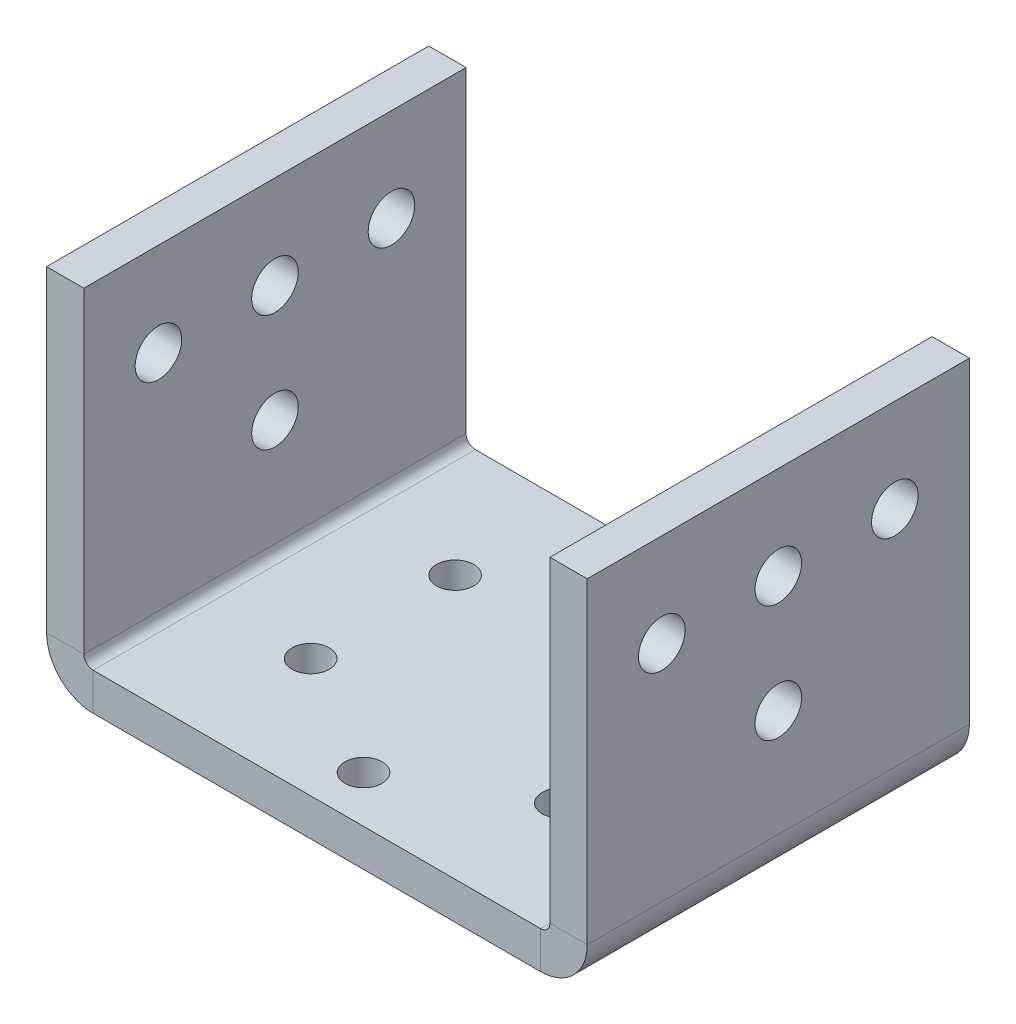
ISO-10303-21;
HEADER;
FILE_DESCRIPTION(('STEP AP214'),'2;1');
FILE_NAME('part.step','',(''),(''),'','','');
FILE_SCHEMA(('AUTOMOTIVE_DESIGN { 1 0 10303 214 1 1 1 1 }'));
ENDSEC;
DATA;
#1=APPLICATION_CONTEXT('core data for automotive mechanical design processes');
#2=APPLICATION_PROTOCOL_DEFINITION('international standard','automotive_design',2000,#1);
#3=PRODUCT_CONTEXT('',#1,'mechanical');
#4=PRODUCT('Part','Part','',(#3));
#5=PRODUCT_RELATED_PRODUCT_CATEGORY('part','',(#4));
#6=PRODUCT_DEFINITION_FORMATION('','',#4);
#7=PRODUCT_DEFINITION_CONTEXT('part definition',#1,'design');
#8=PRODUCT_DEFINITION('design','',#6,#7);
#9=PRODUCT_DEFINITION_SHAPE('','',#8);
#10=(LENGTH_UNIT() NAMED_UNIT(*) SI_UNIT(.MILLI.,.METRE.));
#11=(NAMED_UNIT(*) PLANE_ANGLE_UNIT() SI_UNIT($,.RADIAN.));
#12=(NAMED_UNIT(*) SI_UNIT($,.STERADIAN.) SOLID_ANGLE_UNIT());
#13=UNCERTAINTY_MEASURE_WITH_UNIT(LENGTH_MEASURE(1.E-05),#10,'distance_accuracy_value','');
#14=(GEOMETRIC_REPRESENTATION_CONTEXT(3) GLOBAL_UNCERTAINTY_ASSIGNED_CONTEXT((#13)) GLOBAL_UNIT_ASSIGNED_CONTEXT((#10,
#11,#12)) REPRESENTATION_CONTEXT('',''));
#15=CARTESIAN_POINT('',(0.,0.,0.));
#16=DIRECTION('',(0.,0.,1.));
#17=DIRECTION('',(1.,0.,0.));
#18=AXIS2_PLACEMENT_3D('',#15,#16,#17);
#19=CARTESIAN_POINT('',(25.,1.00000000000001,41.));
#20=DIRECTION('',(0.,0.,1.));
#21=DIRECTION('',(1.,0.,0.));
#22=AXIS2_PLACEMENT_3D('',#19,#20,#21);
#23=PLANE('',#22);
#24=DIRECTION('',(1.,0.,0.));
#25=VECTOR('',#24,1.);
#26=CARTESIAN_POINT('',(25.,1.00000000000001,41.));
#27=LINE('',#26,#25);
#28=CARTESIAN_POINT('',(25.,1.00000000000001,41.));
#29=VERTEX_POINT('',#28);
#30=CARTESIAN_POINT('',(29.,1.00000000000001,41.));
#31=VERTEX_POINT('',#30);
#32=EDGE_CURVE('E11',#29,#31,#27,.T.);
#33=ORIENTED_EDGE('',*,*,#32,.F.);
#34=CARTESIAN_POINT('',(24.,1.00000000000001,41.));
#35=DIRECTION('',(0.,0.,1.));
#36=DIRECTION('',(1.,0.,0.));
#37=AXIS2_PLACEMENT_3D('',#34,#35,#36);
#38=CIRCLE('',#37,1.);
#39=CARTESIAN_POINT('',(24.,0.,41.));
#40=VERTEX_POINT('',#39);
#41=EDGE_CURVE('E158',#29,#40,#38,.F.);
#42=ORIENTED_EDGE('',*,*,#41,.T.);
#43=DIRECTION('',(0.,1.,0.));
#44=VECTOR('',#43,1.);
#45=CARTESIAN_POINT('',(24.,-3.99999999999999,41.));
#46=LINE('',#45,#44);
#47=CARTESIAN_POINT('',(24.,-3.99999999999999,41.));
#48=VERTEX_POINT('',#47);
#49=EDGE_CURVE('E53',#48,#40,#46,.T.);
#50=ORIENTED_EDGE('',*,*,#49,.F.);
#51=CARTESIAN_POINT('',(24.,1.00000000000001,41.));
#52=DIRECTION('',(0.,0.,1.));
#53=DIRECTION('',(1.,0.,0.));
#54=AXIS2_PLACEMENT_3D('',#51,#52,#53);
#55=CIRCLE('',#54,5.);
#56=EDGE_CURVE('E386',#31,#48,#55,.F.);
#57=ORIENTED_EDGE('',*,*,#56,.F.);
#58=EDGE_LOOP('',(#33,#42,#50,#57));
#59=FACE_BOUND('',#58,.T.);
#60=ADVANCED_FACE('F43',(#59),#23,.T.);
#61=CARTESIAN_POINT('',(24.,-3.99999999999999,41.));
#62=DIRECTION('',(0.,0.,1.));
#63=DIRECTION('',(1.,0.,0.));
#64=AXIS2_PLACEMENT_3D('',#61,#62,#63);
#65=PLANE('',#64);
#66=DIRECTION('',(0.,-1.,0.));
#67=VECTOR('',#66,1.);
#68=CARTESIAN_POINT('',(25.,0.,41.));
#69=LINE('',#68,#67);
#70=CARTESIAN_POINT('',(25.,35.,41.));
#71=VERTEX_POINT('',#70);
#72=EDGE_CURVE('E164',#71,#29,#69,.T.);
#73=ORIENTED_EDGE('',*,*,#72,.T.);
#74=ORIENTED_EDGE('',*,*,#32,.T.);
#75=DIRECTION('',(0.,1.,0.));
#76=VECTOR('',#75,1.);
#77=CARTESIAN_POINT('',(29.,0.,41.));
#78=LINE('',#77,#76);
#79=CARTESIAN_POINT('',(29.,35.,41.));
#80=VERTEX_POINT('',#79);
#81=EDGE_CURVE('E389',#80,#31,#78,.F.);
#82=ORIENTED_EDGE('',*,*,#81,.F.);
#83=DIRECTION('',(1.,0.,0.));
#84=VECTOR('',#83,1.);
#85=CARTESIAN_POINT('',(25.,35.,41.));
#86=LINE('',#85,#84);
#87=EDGE_CURVE('E393',#71,#80,#86,.T.);
#88=ORIENTED_EDGE('',*,*,#87,.F.);
#89=EDGE_LOOP('',(#73,#74,#82,#88));
#90=FACE_BOUND('',#89,.T.);
#91=ADVANCED_FACE('F401',(#90),#65,.T.);
#92=CARTESIAN_POINT('',(24.,0.,0.));
#93=DIRECTION('',(0.,0.,-1.));
#94=DIRECTION('',(-1.,0.,0.));
#95=AXIS2_PLACEMENT_3D('',#92,#93,#94);
#96=PLANE('',#95);
#97=DIRECTION('',(0.,-1.,0.));
#98=VECTOR('',#97,1.);
#99=CARTESIAN_POINT('',(24.,0.,0.));
#100=LINE('',#99,#98);
#101=CARTESIAN_POINT('',(24.,0.,0.));
#102=VERTEX_POINT('',#101);
#103=CARTESIAN_POINT('',(24.,-3.99999999999999,0.));
#104=VERTEX_POINT('',#103);
#105=EDGE_CURVE('E155',#102,#104,#100,.T.);
#106=ORIENTED_EDGE('',*,*,#105,.F.);
#107=CARTESIAN_POINT('',(24.,1.00000000000001,0.));
#108=DIRECTION('',(0.,0.,1.));
#109=DIRECTION('',(1.,0.,0.));
#110=AXIS2_PLACEMENT_3D('',#107,#108,#109);
#111=CIRCLE('',#110,1.);
#112=CARTESIAN_POINT('',(25.,1.00000000000001,0.));
#113=VERTEX_POINT('',#112);
#114=EDGE_CURVE('E171',#113,#102,#111,.F.);
#115=ORIENTED_EDGE('',*,*,#114,.F.);
#116=DIRECTION('',(-1.,0.,0.));
#117=VECTOR('',#116,1.);
#118=CARTESIAN_POINT('',(29.,1.00000000000001,0.));
#119=LINE('',#118,#117);
#120=CARTESIAN_POINT('',(29.,1.00000000000001,0.));
#121=VERTEX_POINT('',#120);
#122=EDGE_CURVE('E275',#121,#113,#119,.T.);
#123=ORIENTED_EDGE('',*,*,#122,.F.);
#124=CARTESIAN_POINT('',(24.,1.00000000000001,0.));
#125=DIRECTION('',(0.,0.,1.));
#126=DIRECTION('',(1.,0.,0.));
#127=AXIS2_PLACEMENT_3D('',#124,#125,#126);
#128=CIRCLE('',#127,5.);
#129=EDGE_CURVE('E207',#121,#104,#128,.F.);
#130=ORIENTED_EDGE('',*,*,#129,.T.);
#131=EDGE_LOOP('',(#106,#115,#123,#130));
#132=FACE_BOUND('',#131,.T.);
#133=ADVANCED_FACE('F408',(#132),#96,.T.);
#134=CARTESIAN_POINT('',(29.,1.00000000000001,0.));
#135=DIRECTION('',(0.,0.,-1.));
#136=DIRECTION('',(-1.,0.,0.));
#137=AXIS2_PLACEMENT_3D('',#134,#135,#136);
#138=PLANE('',#137);
#139=DIRECTION('',(-1.,0.,0.));
#140=VECTOR('',#139,1.);
#141=CARTESIAN_POINT('',(-25.,0.,0.));
#142=LINE('',#141,#140);
#143=CARTESIAN_POINT('',(-24.,0.,0.));
#144=VERTEX_POINT('',#143);
#145=EDGE_CURVE('E225',#102,#144,#142,.T.);
#146=ORIENTED_EDGE('',*,*,#145,.F.);
#147=ORIENTED_EDGE('',*,*,#105,.T.);
#148=DIRECTION('',(-1.,0.,0.));
#149=VECTOR('',#148,1.);
#150=CARTESIAN_POINT('',(-25.,-4.,0.));
#151=LINE('',#150,#149);
#152=CARTESIAN_POINT('',(-24.,-4.,0.));
#153=VERTEX_POINT('',#152);
#154=EDGE_CURVE('E204',#104,#153,#151,.T.);
#155=ORIENTED_EDGE('',*,*,#154,.T.);
#156=DIRECTION('',(0.,1.,0.));
#157=VECTOR('',#156,1.);
#158=CARTESIAN_POINT('',(-24.,-4.,0.));
#159=LINE('',#158,#157);
#160=EDGE_CURVE('E103',#153,#144,#159,.T.);
#161=ORIENTED_EDGE('',*,*,#160,.T.);
#162=EDGE_LOOP('',(#146,#147,#155,#161));
#163=FACE_BOUND('',#162,.T.);
#164=ADVANCED_FACE('F410',(#163),#138,.T.);
#165=CARTESIAN_POINT('',(-24.,0.,41.));
#166=DIRECTION('',(0.,0.,1.));
#167=DIRECTION('',(1.,0.,0.));
#168=AXIS2_PLACEMENT_3D('',#165,#166,#167);
#169=PLANE('',#168);
#170=DIRECTION('',(0.,-1.,0.));
#171=VECTOR('',#170,1.);
#172=CARTESIAN_POINT('',(-24.,0.,41.));
#173=LINE('',#172,#171);
#174=CARTESIAN_POINT('',(-24.,0.,41.));
#175=VERTEX_POINT('',#174);
#176=CARTESIAN_POINT('',(-24.,-4.,41.));
#177=VERTEX_POINT('',#176);
#178=EDGE_CURVE('E272',#175,#177,#173,.T.);
#179=ORIENTED_EDGE('',*,*,#178,.F.);
#180=CARTESIAN_POINT('',(-24.,1.,41.));
#181=DIRECTION('',(0.,0.,1.));
#182=DIRECTION('',(1.,0.,0.));
#183=AXIS2_PLACEMENT_3D('',#180,#181,#182);
#184=CIRCLE('',#183,1.);
#185=CARTESIAN_POINT('',(-25.,1.,41.));
#186=VERTEX_POINT('',#185);
#187=EDGE_CURVE('E181',#175,#186,#184,.F.);
#188=ORIENTED_EDGE('',*,*,#187,.T.);
#189=DIRECTION('',(1.,0.,0.));
#190=VECTOR('',#189,1.);
#191=CARTESIAN_POINT('',(-29.,1.,41.));
#192=LINE('',#191,#190);
#193=CARTESIAN_POINT('',(-29.,1.,41.));
#194=VERTEX_POINT('',#193);
#195=EDGE_CURVE('E62',#194,#186,#192,.T.);
#196=ORIENTED_EDGE('',*,*,#195,.F.);
#197=CARTESIAN_POINT('',(-24.,1.,41.));
#198=DIRECTION('',(0.,0.,1.));
#199=DIRECTION('',(1.,0.,0.));
#200=AXIS2_PLACEMENT_3D('',#197,#198,#199);
#201=CIRCLE('',#200,5.);
#202=EDGE_CURVE('E380',#177,#194,#201,.F.);
#203=ORIENTED_EDGE('',*,*,#202,.F.);
#204=EDGE_LOOP('',(#179,#188,#196,#203));
#205=FACE_BOUND('',#204,.T.);
#206=ADVANCED_FACE('F460',(#205),#169,.T.);
#207=CARTESIAN_POINT('',(-29.,1.,41.));
#208=DIRECTION('',(0.,0.,1.));
#209=DIRECTION('',(1.,0.,0.));
#210=AXIS2_PLACEMENT_3D('',#207,#208,#209);
#211=PLANE('',#210);
#212=DIRECTION('',(-1.,0.,0.));
#213=VECTOR('',#212,1.);
#214=CARTESIAN_POINT('',(-25.,0.,41.));
#215=LINE('',#214,#213);
#216=EDGE_CURVE('E146',#40,#175,#215,.T.);
#217=ORIENTED_EDGE('',*,*,#216,.T.);
#218=ORIENTED_EDGE('',*,*,#178,.T.);
#219=DIRECTION('',(-1.,0.,0.));
#220=VECTOR('',#219,1.);
#221=CARTESIAN_POINT('',(-25.,-4.,41.));
#222=LINE('',#221,#220);
#223=EDGE_CURVE('E149',#48,#177,#222,.T.);
#224=ORIENTED_EDGE('',*,*,#223,.F.);
#225=ORIENTED_EDGE('',*,*,#49,.T.);
#226=EDGE_LOOP('',(#217,#218,#224,#225));
#227=FACE_BOUND('',#226,.T.);
#228=ADVANCED_FACE('F144',(#227),#211,.T.);
#229=CARTESIAN_POINT('',(-25.,1.,0.));
#230=DIRECTION('',(0.,0.,-1.));
#231=DIRECTION('',(-1.,0.,0.));
#232=AXIS2_PLACEMENT_3D('',#229,#230,#231);
#233=PLANE('',#232);
#234=DIRECTION('',(-1.,0.,0.));
#235=VECTOR('',#234,1.);
#236=CARTESIAN_POINT('',(-25.,1.,0.));
#237=LINE('',#236,#235);
#238=CARTESIAN_POINT('',(-25.,1.,0.));
#239=VERTEX_POINT('',#238);
#240=CARTESIAN_POINT('',(-29.,1.,0.));
#241=VERTEX_POINT('',#240);
#242=EDGE_CURVE('E110',#239,#241,#237,.T.);
#243=ORIENTED_EDGE('',*,*,#242,.F.);
#244=CARTESIAN_POINT('',(-24.,1.,0.));
#245=DIRECTION('',(0.,0.,1.));
#246=DIRECTION('',(1.,0.,0.));
#247=AXIS2_PLACEMENT_3D('',#244,#245,#246);
#248=CIRCLE('',#247,1.);
#249=EDGE_CURVE('E228',#144,#239,#248,.F.);
#250=ORIENTED_EDGE('',*,*,#249,.F.);
#251=ORIENTED_EDGE('',*,*,#160,.F.);
#252=CARTESIAN_POINT('',(-24.,1.,0.));
#253=DIRECTION('',(0.,0.,1.));
#254=DIRECTION('',(1.,0.,0.));
#255=AXIS2_PLACEMENT_3D('',#252,#253,#254);
#256=CIRCLE('',#255,5.);
#257=EDGE_CURVE('E201',#153,#241,#256,.F.);
#258=ORIENTED_EDGE('',*,*,#257,.T.);
#259=EDGE_LOOP('',(#243,#250,#251,#258));
#260=FACE_BOUND('',#259,.T.);
#261=ADVANCED_FACE('F423',(#260),#233,.T.);
#262=CARTESIAN_POINT('',(-24.,-4.,0.));
#263=DIRECTION('',(0.,0.,-1.));
#264=DIRECTION('',(-1.,0.,0.));
#265=AXIS2_PLACEMENT_3D('',#262,#263,#264);
#266=PLANE('',#265);
#267=DIRECTION('',(0.,1.,0.));
#268=VECTOR('',#267,1.);
#269=CARTESIAN_POINT('',(-25.,0.,0.));
#270=LINE('',#269,#268);
#271=CARTESIAN_POINT('',(-25.,35.,0.));
#272=VERTEX_POINT('',#271);
#273=EDGE_CURVE('E188',#239,#272,#270,.T.);
#274=ORIENTED_EDGE('',*,*,#273,.F.);
#275=ORIENTED_EDGE('',*,*,#242,.T.);
#276=DIRECTION('',(0.,1.,0.));
#277=VECTOR('',#276,1.);
#278=CARTESIAN_POINT('',(-29.,0.,0.));
#279=LINE('',#278,#277);
#280=CARTESIAN_POINT('',(-29.,35.,0.));
#281=VERTEX_POINT('',#280);
#282=EDGE_CURVE('E197',#241,#281,#279,.T.);
#283=ORIENTED_EDGE('',*,*,#282,.T.);
#284=DIRECTION('',(1.,0.,0.));
#285=VECTOR('',#284,1.);
#286=CARTESIAN_POINT('',(-29.,35.,0.));
#287=LINE('',#286,#285);
#288=EDGE_CURVE('E192',#281,#272,#287,.T.);
#289=ORIENTED_EDGE('',*,*,#288,.T.);
#290=EDGE_LOOP('',(#274,#275,#283,#289));
#291=FACE_BOUND('',#290,.T.);
#292=ADVANCED_FACE('F431',(#291),#266,.T.);
#293=CARTESIAN_POINT('',(-25.,0.,41.));
#294=DIRECTION('',(-1.,0.,0.));
#295=DIRECTION('',(0.,0.,1.));
#296=AXIS2_PLACEMENT_3D('',#293,#294,#295);
#297=PLANE('',#296);
#298=CARTESIAN_POINT('',(-25.,12.5,20.5));
#299=DIRECTION('',(-1.,0.,0.));
#300=DIRECTION('',(0.,0.,1.));
#301=AXIS2_PLACEMENT_3D('',#298,#299,#300);
#302=CIRCLE('',#301,2.5);
#303=CARTESIAN_POINT('',(-25.,12.5,23.));
#304=VERTEX_POINT('',#303);
#305=EDGE_CURVE('E343',#304,#304,#302,.T.);
#306=ORIENTED_EDGE('',*,*,#305,.T.);
#307=EDGE_LOOP('',(#306));
#308=FACE_BOUND('',#307,.T.);
#309=CARTESIAN_POINT('',(-25.,25.,33.));
#310=DIRECTION('',(-1.,0.,0.));
#311=DIRECTION('',(0.,0.,1.));
#312=AXIS2_PLACEMENT_3D('',#309,#310,#311);
#313=CIRCLE('',#312,2.5);
#314=CARTESIAN_POINT('',(-25.,25.,35.5));
#315=VERTEX_POINT('',#314);
#316=EDGE_CURVE('E325',#315,#315,#313,.T.);
#317=ORIENTED_EDGE('',*,*,#316,.T.);
#318=EDGE_LOOP('',(#317));
#319=FACE_BOUND('',#318,.T.);
#320=CARTESIAN_POINT('',(-25.,25.,20.5));
#321=DIRECTION('',(-1.,0.,0.));
#322=DIRECTION('',(0.,0.,1.));
#323=AXIS2_PLACEMENT_3D('',#320,#321,#322);
#324=CIRCLE('',#323,2.5);
#325=CARTESIAN_POINT('',(-25.,25.,23.));
#326=VERTEX_POINT('',#325);
#327=EDGE_CURVE('E319',#326,#326,#324,.T.);
#328=ORIENTED_EDGE('',*,*,#327,.T.);
#329=EDGE_LOOP('',(#328));
#330=FACE_BOUND('',#329,.T.);
#331=CARTESIAN_POINT('',(-25.,25.,8.));
#332=DIRECTION('',(-1.,0.,0.));
#333=DIRECTION('',(0.,0.,1.));
#334=AXIS2_PLACEMENT_3D('',#331,#332,#333);
#335=CIRCLE('',#334,2.5);
#336=CARTESIAN_POINT('',(-25.,25.,10.5));
#337=VERTEX_POINT('',#336);
#338=EDGE_CURVE('E314',#337,#337,#335,.T.);
#339=ORIENTED_EDGE('',*,*,#338,.T.);
#340=EDGE_LOOP('',(#339));
#341=FACE_BOUND('',#340,.T.);
#342=ORIENTED_EDGE('',*,*,#273,.T.);
#343=DIRECTION('',(0.,0.,-1.));
#344=VECTOR('',#343,1.);
#345=CARTESIAN_POINT('',(-25.,35.,41.));
#346=LINE('',#345,#344);
#347=CARTESIAN_POINT('',(-25.,35.,41.));
#348=VERTEX_POINT('',#347);
#349=EDGE_CURVE('E263',#348,#272,#346,.T.);
#350=ORIENTED_EDGE('',*,*,#349,.F.);
#351=DIRECTION('',(0.,1.,0.));
#352=VECTOR('',#351,1.);
#353=CARTESIAN_POINT('',(-25.,0.,41.));
#354=LINE('',#353,#352);
#355=EDGE_CURVE('E116',#186,#348,#354,.T.);
#356=ORIENTED_EDGE('',*,*,#355,.F.);
#357=DIRECTION('',(0.,0.,-1.));
#358=VECTOR('',#357,1.);
#359=CARTESIAN_POINT('',(-25.,1.,41.));
#360=LINE('',#359,#358);
#361=EDGE_CURVE('E184',#186,#239,#360,.T.);
#362=ORIENTED_EDGE('',*,*,#361,.T.);
#363=EDGE_LOOP('',(#342,#350,#356,#362));
#364=FACE_BOUND('',#363,.T.);
#365=ADVANCED_FACE('F429',(#308,#319,#330,#341,#364),#297,.F.);
#366=CARTESIAN_POINT('',(-29.,35.,41.));
#367=DIRECTION('',(0.,1.,0.));
#368=DIRECTION('',(0.,0.,1.));
#369=AXIS2_PLACEMENT_3D('',#366,#367,#368);
#370=PLANE('',#369);
#371=ORIENTED_EDGE('',*,*,#288,.F.);
#372=DIRECTION('',(0.,0.,-1.));
#373=VECTOR('',#372,1.);
#374=CARTESIAN_POINT('',(-29.,35.,41.));
#375=LINE('',#374,#373);
#376=CARTESIAN_POINT('',(-29.,35.,41.));
#377=VERTEX_POINT('',#376);
#378=EDGE_CURVE('E260',#377,#281,#375,.T.);
#379=ORIENTED_EDGE('',*,*,#378,.F.);
#380=DIRECTION('',(1.,0.,0.));
#381=VECTOR('',#380,1.);
#382=CARTESIAN_POINT('',(-29.,35.,41.));
#383=LINE('',#382,#381);
#384=EDGE_CURVE('E372',#377,#348,#383,.T.);
#385=ORIENTED_EDGE('',*,*,#384,.T.);
#386=ORIENTED_EDGE('',*,*,#349,.T.);
#387=EDGE_LOOP('',(#371,#379,#385,#386));
#388=FACE_BOUND('',#387,.T.);
#389=ADVANCED_FACE('F434',(#388),#370,.T.);
#390=CARTESIAN_POINT('',(-29.,0.,41.));
#391=DIRECTION('',(-1.,0.,0.));
#392=DIRECTION('',(0.,0.,1.));
#393=AXIS2_PLACEMENT_3D('',#390,#391,#392);
#394=PLANE('',#393);
#395=CARTESIAN_POINT('',(-29.,12.5,20.5));
#396=DIRECTION('',(1.,0.,0.));
#397=DIRECTION('',(0.,0.,-1.));
#398=AXIS2_PLACEMENT_3D('',#395,#396,#397);
#399=CIRCLE('',#398,2.5);
#400=CARTESIAN_POINT('',(-29.,12.5,18.));
#401=VERTEX_POINT('',#400);
#402=EDGE_CURVE('E309',#401,#401,#399,.T.);
#403=ORIENTED_EDGE('',*,*,#402,.T.);
#404=EDGE_LOOP('',(#403));
#405=FACE_BOUND('',#404,.T.);
#406=CARTESIAN_POINT('',(-29.,25.,33.));
#407=DIRECTION('',(1.,0.,0.));
#408=DIRECTION('',(0.,0.,-1.));
#409=AXIS2_PLACEMENT_3D('',#406,#407,#408);
#410=CIRCLE('',#409,2.5);
#411=CARTESIAN_POINT('',(-29.,25.,30.5));
#412=VERTEX_POINT('',#411);
#413=EDGE_CURVE('E494',#412,#412,#410,.T.);
#414=ORIENTED_EDGE('',*,*,#413,.T.);
#415=EDGE_LOOP('',(#414));
#416=FACE_BOUND('',#415,.T.);
#417=CARTESIAN_POINT('',(-29.,25.,20.5));
#418=DIRECTION('',(1.,0.,0.));
#419=DIRECTION('',(0.,0.,-1.));
#420=AXIS2_PLACEMENT_3D('',#417,#418,#419);
#421=CIRCLE('',#420,2.5);
#422=CARTESIAN_POINT('',(-29.,25.,18.));
#423=VERTEX_POINT('',#422);
#424=EDGE_CURVE('E490',#423,#423,#421,.T.);
#425=ORIENTED_EDGE('',*,*,#424,.T.);
#426=EDGE_LOOP('',(#425));
#427=FACE_BOUND('',#426,.T.);
#428=CARTESIAN_POINT('',(-29.,25.,8.));
#429=DIRECTION('',(1.,0.,0.));
#430=DIRECTION('',(0.,0.,-1.));
#431=AXIS2_PLACEMENT_3D('',#428,#429,#430);
#432=CIRCLE('',#431,2.5);
#433=CARTESIAN_POINT('',(-29.,25.,5.5));
#434=VERTEX_POINT('',#433);
#435=EDGE_CURVE('E486',#434,#434,#432,.T.);
#436=ORIENTED_EDGE('',*,*,#435,.T.);
#437=EDGE_LOOP('',(#436));
#438=FACE_BOUND('',#437,.T.);
#439=ORIENTED_EDGE('',*,*,#282,.F.);
#440=DIRECTION('',(0.,0.,-1.));
#441=VECTOR('',#440,1.);
#442=CARTESIAN_POINT('',(-29.,1.,41.));
#443=LINE('',#442,#441);
#444=EDGE_CURVE('E256',#194,#241,#443,.T.);
#445=ORIENTED_EDGE('',*,*,#444,.F.);
#446=DIRECTION('',(0.,1.,0.));
#447=VECTOR('',#446,1.);
#448=CARTESIAN_POINT('',(-29.,0.,41.));
#449=LINE('',#448,#447);
#450=EDGE_CURVE('E376',#194,#377,#449,.T.);
#451=ORIENTED_EDGE('',*,*,#450,.T.);
#452=ORIENTED_EDGE('',*,*,#378,.T.);
#453=EDGE_LOOP('',(#439,#445,#451,#452));
#454=FACE_BOUND('',#453,.T.);
#455=ADVANCED_FACE('F437',(#405,#416,#427,#438,#454),#394,.T.);
#456=CARTESIAN_POINT('',(-24.,1.,41.));
#457=DIRECTION('',(0.,0.,-1.));
#458=DIRECTION('',(-1.,0.,0.));
#459=AXIS2_PLACEMENT_3D('',#456,#457,#458);
#460=CYLINDRICAL_SURFACE('',#459,5.);
#461=ORIENTED_EDGE('',*,*,#257,.F.);
#462=DIRECTION('',(0.,0.,-1.));
#463=VECTOR('',#462,1.);
#464=CARTESIAN_POINT('',(-24.,-4.,41.));
#465=LINE('',#464,#463);
#466=EDGE_CURVE('E252',#177,#153,#465,.T.);
#467=ORIENTED_EDGE('',*,*,#466,.F.);
#468=ORIENTED_EDGE('',*,*,#202,.T.);
#469=ORIENTED_EDGE('',*,*,#444,.T.);
#470=EDGE_LOOP('',(#461,#467,#468,#469));
#471=FACE_BOUND('',#470,.T.);
#472=ADVANCED_FACE('F420',(#471),#460,.T.);
#473=CARTESIAN_POINT('',(-25.,-4.,41.));
#474=DIRECTION('',(0.,-1.,0.));
#475=DIRECTION('',(1.,0.,0.));
#476=AXIS2_PLACEMENT_3D('',#473,#474,#475);
#477=PLANE('',#476);
#478=CARTESIAN_POINT('',(-13.4233937586588,-4.,12.75));
#479=DIRECTION('',(0.,-1.,0.));
#480=DIRECTION('',(1.,0.,0.));
#481=AXIS2_PLACEMENT_3D('',#478,#479,#480);
#482=CIRCLE('',#481,1.99999999999997);
#483=CARTESIAN_POINT('',(-11.4233937586588,-4.,12.75));
#484=VERTEX_POINT('',#483);
#485=EDGE_CURVE('E347',#484,#484,#482,.T.);
#486=ORIENTED_EDGE('',*,*,#485,.F.);
#487=EDGE_LOOP('',(#486));
#488=FACE_BOUND('',#487,.T.);
#489=CARTESIAN_POINT('',(0.,-4.,5.));
#490=DIRECTION('',(0.,-1.,0.));
#491=DIRECTION('',(1.,0.,0.));
#492=AXIS2_PLACEMENT_3D('',#489,#490,#491);
#493=CIRCLE('',#492,2.00000000000001);
#494=CARTESIAN_POINT('',(2.00000000000001,-4.,5.));
#495=VERTEX_POINT('',#494);
#496=EDGE_CURVE('E360',#495,#495,#493,.T.);
#497=ORIENTED_EDGE('',*,*,#496,.F.);
#498=EDGE_LOOP('',(#497));
#499=FACE_BOUND('',#498,.T.);
#500=CARTESIAN_POINT('',(13.4233937586588,-3.99999999999999,12.75));
#501=DIRECTION('',(0.,-1.,0.));
#502=DIRECTION('',(1.,0.,0.));
#503=AXIS2_PLACEMENT_3D('',#500,#501,#502);
#504=CIRCLE('',#503,2.);
#505=CARTESIAN_POINT('',(15.4233937586588,-3.99999999999999,12.75));
#506=VERTEX_POINT('',#505);
#507=EDGE_CURVE('E356',#506,#506,#504,.T.);
#508=ORIENTED_EDGE('',*,*,#507,.F.);
#509=EDGE_LOOP('',(#508));
#510=FACE_BOUND('',#509,.T.);
#511=CARTESIAN_POINT('',(13.4233937586588,-3.99999999999999,28.25));
#512=DIRECTION('',(0.,-1.,0.));
#513=DIRECTION('',(1.,0.,0.));
#514=AXIS2_PLACEMENT_3D('',#511,#512,#513);
#515=CIRCLE('',#514,2.);
#516=CARTESIAN_POINT('',(15.4233937586588,-3.99999999999999,28.25));
#517=VERTEX_POINT('',#516);
#518=EDGE_CURVE('E352',#517,#517,#515,.T.);
#519=ORIENTED_EDGE('',*,*,#518,.F.);
#520=EDGE_LOOP('',(#519));
#521=FACE_BOUND('',#520,.T.);
#522=CARTESIAN_POINT('',(0.,-4.,36.));
#523=DIRECTION('',(0.,-1.,0.));
#524=DIRECTION('',(1.,0.,0.));
#525=AXIS2_PLACEMENT_3D('',#522,#523,#524);
#526=CIRCLE('',#525,2.);
#527=CARTESIAN_POINT('',(2.,-4.,36.));
#528=VERTEX_POINT('',#527);
#529=EDGE_CURVE('E348',#528,#528,#526,.T.);
#530=ORIENTED_EDGE('',*,*,#529,.F.);
#531=EDGE_LOOP('',(#530));
#532=FACE_BOUND('',#531,.T.);
#533=CARTESIAN_POINT('',(-13.4233937586588,-4.,28.25));
#534=DIRECTION('',(0.,-1.,0.));
#535=DIRECTION('',(1.,0.,0.));
#536=AXIS2_PLACEMENT_3D('',#533,#534,#535);
#537=CIRCLE('',#536,2.);
#538=CARTESIAN_POINT('',(-11.4233937586588,-4.,28.25));
#539=VERTEX_POINT('',#538);
#540=EDGE_CURVE('E285',#539,#539,#537,.T.);
#541=ORIENTED_EDGE('',*,*,#540,.F.);
#542=EDGE_LOOP('',(#541));
#543=FACE_BOUND('',#542,.T.);
#544=ORIENTED_EDGE('',*,*,#154,.F.);
#545=DIRECTION('',(0.,0.,-1.));
#546=VECTOR('',#545,1.);
#547=CARTESIAN_POINT('',(24.,-3.99999999999999,41.));
#548=LINE('',#547,#546);
#549=EDGE_CURVE('E248',#48,#104,#548,.T.);
#550=ORIENTED_EDGE('',*,*,#549,.F.);
#551=ORIENTED_EDGE('',*,*,#223,.T.);
#552=ORIENTED_EDGE('',*,*,#466,.T.);
#553=EDGE_LOOP('',(#544,#550,#551,#552));
#554=FACE_BOUND('',#553,.T.);
#555=ADVANCED_FACE('F415',(#488,#499,#510,#521,#532,#543,#554),#477,.T.);
#556=CARTESIAN_POINT('',(24.,1.00000000000001,41.));
#557=DIRECTION('',(0.,0.,-1.));
#558=DIRECTION('',(-1.,0.,0.));
#559=AXIS2_PLACEMENT_3D('',#556,#557,#558);
#560=CYLINDRICAL_SURFACE('',#559,5.);
#561=ORIENTED_EDGE('',*,*,#129,.F.);
#562=DIRECTION('',(0.,0.,-1.));
#563=VECTOR('',#562,1.);
#564=CARTESIAN_POINT('',(29.,1.00000000000001,41.));
#565=LINE('',#564,#563);
#566=EDGE_CURVE('E244',#31,#121,#565,.T.);
#567=ORIENTED_EDGE('',*,*,#566,.F.);
#568=ORIENTED_EDGE('',*,*,#56,.T.);
#569=ORIENTED_EDGE('',*,*,#549,.T.);
#570=EDGE_LOOP('',(#561,#567,#568,#569));
#571=FACE_BOUND('',#570,.T.);
#572=ADVANCED_FACE('F413',(#571),#560,.T.);
#573=CARTESIAN_POINT('',(29.,0.,41.));
#574=DIRECTION('',(1.,0.,0.));
#575=DIRECTION('',(0.,0.,-1.));
#576=AXIS2_PLACEMENT_3D('',#573,#574,#575);
#577=PLANE('',#576);
#578=CARTESIAN_POINT('',(29.,12.5,20.5));
#579=DIRECTION('',(1.,0.,0.));
#580=DIRECTION('',(0.,0.,-1.));
#581=AXIS2_PLACEMENT_3D('',#578,#579,#580);
#582=CIRCLE('',#581,2.5);
#583=CARTESIAN_POINT('',(29.,12.5,18.));
#584=VERTEX_POINT('',#583);
#585=EDGE_CURVE('E339',#584,#584,#582,.T.);
#586=ORIENTED_EDGE('',*,*,#585,.F.);
#587=EDGE_LOOP('',(#586));
#588=FACE_BOUND('',#587,.T.);
#589=CARTESIAN_POINT('',(29.,25.,33.));
#590=DIRECTION('',(1.,0.,0.));
#591=DIRECTION('',(0.,0.,-1.));
#592=AXIS2_PLACEMENT_3D('',#589,#590,#591);
#593=CIRCLE('',#592,2.5);
#594=CARTESIAN_POINT('',(29.,25.,30.5));
#595=VERTEX_POINT('',#594);
#596=EDGE_CURVE('E318',#595,#595,#593,.T.);
#597=ORIENTED_EDGE('',*,*,#596,.F.);
#598=EDGE_LOOP('',(#597));
#599=FACE_BOUND('',#598,.T.);
#600=CARTESIAN_POINT('',(29.,25.,20.5));
#601=DIRECTION('',(1.,0.,0.));
#602=DIRECTION('',(0.,0.,-1.));
#603=AXIS2_PLACEMENT_3D('',#600,#601,#602);
#604=CIRCLE('',#603,2.5);
#605=CARTESIAN_POINT('',(29.,25.,18.));
#606=VERTEX_POINT('',#605);
#607=EDGE_CURVE('E313',#606,#606,#604,.T.);
#608=ORIENTED_EDGE('',*,*,#607,.F.);
#609=EDGE_LOOP('',(#608));
#610=FACE_BOUND('',#609,.T.);
#611=CARTESIAN_POINT('',(29.,25.,8.));
#612=DIRECTION('',(1.,0.,0.));
#613=DIRECTION('',(0.,0.,-1.));
#614=AXIS2_PLACEMENT_3D('',#611,#612,#613);
#615=CIRCLE('',#614,2.5);
#616=CARTESIAN_POINT('',(29.,25.,5.5));
#617=VERTEX_POINT('',#616);
#618=EDGE_CURVE('E308',#617,#617,#615,.T.);
#619=ORIENTED_EDGE('',*,*,#618,.F.);
#620=EDGE_LOOP('',(#619));
#621=FACE_BOUND('',#620,.T.);
#622=DIRECTION('',(0.,1.,0.));
#623=VECTOR('',#622,1.);
#624=CARTESIAN_POINT('',(29.,0.,0.));
#625=LINE('',#624,#623);
#626=CARTESIAN_POINT('',(29.,35.,0.));
#627=VERTEX_POINT('',#626);
#628=EDGE_CURVE('E211',#627,#121,#625,.F.);
#629=ORIENTED_EDGE('',*,*,#628,.F.);
#630=DIRECTION('',(0.,0.,-1.));
#631=VECTOR('',#630,1.);
#632=CARTESIAN_POINT('',(29.,35.,41.));
#633=LINE('',#632,#631);
#634=EDGE_CURVE('E241',#80,#627,#633,.T.);
#635=ORIENTED_EDGE('',*,*,#634,.F.);
#636=ORIENTED_EDGE('',*,*,#81,.T.);
#637=ORIENTED_EDGE('',*,*,#566,.T.);
#638=EDGE_LOOP('',(#629,#635,#636,#637));
#639=FACE_BOUND('',#638,.T.);
#640=ADVANCED_FACE('F587',(#588,#599,#610,#621,#639),#577,.T.);
#641=CARTESIAN_POINT('',(25.,35.,41.));
#642=DIRECTION('',(0.,1.,0.));
#643=DIRECTION('',(0.,0.,1.));
#644=AXIS2_PLACEMENT_3D('',#641,#642,#643);
#645=PLANE('',#644);
#646=DIRECTION('',(1.,0.,0.));
#647=VECTOR('',#646,1.);
#648=CARTESIAN_POINT('',(25.,35.,0.));
#649=LINE('',#648,#647);
#650=CARTESIAN_POINT('',(25.,35.,0.));
#651=VERTEX_POINT('',#650);
#652=EDGE_CURVE('E215',#651,#627,#649,.T.);
#653=ORIENTED_EDGE('',*,*,#652,.F.);
#654=DIRECTION('',(0.,0.,-1.));
#655=VECTOR('',#654,1.);
#656=CARTESIAN_POINT('',(25.,35.,41.));
#657=LINE('',#656,#655);
#658=EDGE_CURVE('E238',#71,#651,#657,.T.);
#659=ORIENTED_EDGE('',*,*,#658,.F.);
#660=ORIENTED_EDGE('',*,*,#87,.T.);
#661=ORIENTED_EDGE('',*,*,#634,.T.);
#662=EDGE_LOOP('',(#653,#659,#660,#661));
#663=FACE_BOUND('',#662,.T.);
#664=ADVANCED_FACE('F533',(#663),#645,.T.);
#665=CARTESIAN_POINT('',(25.,0.,41.));
#666=DIRECTION('',(1.,0.,0.));
#667=DIRECTION('',(0.,0.,-1.));
#668=AXIS2_PLACEMENT_3D('',#665,#666,#667);
#669=PLANE('',#668);
#670=CARTESIAN_POINT('',(25.,12.5,20.5));
#671=DIRECTION('',(1.,0.,0.));
#672=DIRECTION('',(0.,0.,-1.));
#673=AXIS2_PLACEMENT_3D('',#670,#671,#672);
#674=CIRCLE('',#673,2.5);
#675=CARTESIAN_POINT('',(25.,12.5,18.));
#676=VERTEX_POINT('',#675);
#677=EDGE_CURVE('E46',#676,#676,#674,.T.);
#678=ORIENTED_EDGE('',*,*,#677,.T.);
#679=EDGE_LOOP('',(#678));
#680=FACE_BOUND('',#679,.T.);
#681=CARTESIAN_POINT('',(25.,25.,33.));
#682=DIRECTION('',(1.,0.,0.));
#683=DIRECTION('',(0.,0.,-1.));
#684=AXIS2_PLACEMENT_3D('',#681,#682,#683);
#685=CIRCLE('',#684,2.5);
#686=CARTESIAN_POINT('',(25.,25.,30.5));
#687=VERTEX_POINT('',#686);
#688=EDGE_CURVE('E315',#687,#687,#685,.T.);
#689=ORIENTED_EDGE('',*,*,#688,.T.);
#690=EDGE_LOOP('',(#689));
#691=FACE_BOUND('',#690,.T.);
#692=CARTESIAN_POINT('',(25.,25.,20.5));
#693=DIRECTION('',(1.,0.,0.));
#694=DIRECTION('',(0.,0.,-1.));
#695=AXIS2_PLACEMENT_3D('',#692,#693,#694);
#696=CIRCLE('',#695,2.5);
#697=CARTESIAN_POINT('',(25.,25.,18.));
#698=VERTEX_POINT('',#697);
#699=EDGE_CURVE('E310',#698,#698,#696,.T.);
#700=ORIENTED_EDGE('',*,*,#699,.T.);
#701=EDGE_LOOP('',(#700));
#702=FACE_BOUND('',#701,.T.);
#703=CARTESIAN_POINT('',(25.,25.,8.));
#704=DIRECTION('',(1.,0.,0.));
#705=DIRECTION('',(0.,0.,-1.));
#706=AXIS2_PLACEMENT_3D('',#703,#704,#705);
#707=CIRCLE('',#706,2.5);
#708=CARTESIAN_POINT('',(25.,25.,5.5));
#709=VERTEX_POINT('',#708);
#710=EDGE_CURVE('E304',#709,#709,#707,.T.);
#711=ORIENTED_EDGE('',*,*,#710,.T.);
#712=EDGE_LOOP('',(#711));
#713=FACE_BOUND('',#712,.T.);
#714=DIRECTION('',(0.,-1.,0.));
#715=VECTOR('',#714,1.);
#716=CARTESIAN_POINT('',(25.,0.,0.));
#717=LINE('',#716,#715);
#718=EDGE_CURVE('E219',#651,#113,#717,.T.);
#719=ORIENTED_EDGE('',*,*,#718,.T.);
#720=DIRECTION('',(0.,0.,-1.));
#721=VECTOR('',#720,1.);
#722=CARTESIAN_POINT('',(25.,1.00000000000001,41.));
#723=LINE('',#722,#721);
#724=EDGE_CURVE('E174',#29,#113,#723,.T.);
#725=ORIENTED_EDGE('',*,*,#724,.F.);
#726=ORIENTED_EDGE('',*,*,#72,.F.);
#727=ORIENTED_EDGE('',*,*,#658,.T.);
#728=EDGE_LOOP('',(#719,#725,#726,#727));
#729=FACE_BOUND('',#728,.T.);
#730=ADVANCED_FACE('F405',(#680,#691,#702,#713,#729),#669,.F.);
#731=CARTESIAN_POINT('',(24.,1.00000000000001,41.));
#732=DIRECTION('',(0.,0.,-1.));
#733=DIRECTION('',(-1.,0.,0.));
#734=AXIS2_PLACEMENT_3D('',#731,#732,#733);
#735=CYLINDRICAL_SURFACE('',#734,1.);
#736=ORIENTED_EDGE('',*,*,#114,.T.);
#737=DIRECTION('',(0.,0.,-1.));
#738=VECTOR('',#737,1.);
#739=CARTESIAN_POINT('',(24.,0.,41.));
#740=LINE('',#739,#738);
#741=EDGE_CURVE('E168',#40,#102,#740,.T.);
#742=ORIENTED_EDGE('',*,*,#741,.F.);
#743=ORIENTED_EDGE('',*,*,#41,.F.);
#744=ORIENTED_EDGE('',*,*,#724,.T.);
#745=EDGE_LOOP('',(#736,#742,#743,#744));
#746=FACE_BOUND('',#745,.T.);
#747=ADVANCED_FACE('F169',(#746),#735,.F.);
#748=CARTESIAN_POINT('',(-25.,0.,41.));
#749=DIRECTION('',(0.,-1.,0.));
#750=DIRECTION('',(1.,0.,0.));
#751=AXIS2_PLACEMENT_3D('',#748,#749,#750);
#752=PLANE('',#751);
#753=CARTESIAN_POINT('',(-13.4233937586588,0.,12.75));
#754=DIRECTION('',(0.,-1.,0.));
#755=DIRECTION('',(1.,0.,0.));
#756=AXIS2_PLACEMENT_3D('',#753,#754,#755);
#757=CIRCLE('',#756,1.99999999999997);
#758=CARTESIAN_POINT('',(-11.4233937586588,0.,12.75));
#759=VERTEX_POINT('',#758);
#760=EDGE_CURVE('E193',#759,#759,#757,.T.);
#761=ORIENTED_EDGE('',*,*,#760,.T.);
#762=EDGE_LOOP('',(#761));
#763=FACE_BOUND('',#762,.T.);
#764=CARTESIAN_POINT('',(0.,0.,5.));
#765=DIRECTION('',(0.,-1.,0.));
#766=DIRECTION('',(1.,0.,0.));
#767=AXIS2_PLACEMENT_3D('',#764,#765,#766);
#768=CIRCLE('',#767,2.00000000000001);
#769=CARTESIAN_POINT('',(2.00000000000001,0.,5.));
#770=VERTEX_POINT('',#769);
#771=EDGE_CURVE('E297',#770,#770,#768,.T.);
#772=ORIENTED_EDGE('',*,*,#771,.T.);
#773=EDGE_LOOP('',(#772));
#774=FACE_BOUND('',#773,.T.);
#775=CARTESIAN_POINT('',(13.4233937586588,0.,12.75));
#776=DIRECTION('',(0.,-1.,0.));
#777=DIRECTION('',(1.,0.,0.));
#778=AXIS2_PLACEMENT_3D('',#775,#776,#777);
#779=CIRCLE('',#778,2.);
#780=CARTESIAN_POINT('',(15.4233937586588,0.,12.75));
#781=VERTEX_POINT('',#780);
#782=EDGE_CURVE('E293',#781,#781,#779,.T.);
#783=ORIENTED_EDGE('',*,*,#782,.T.);
#784=EDGE_LOOP('',(#783));
#785=FACE_BOUND('',#784,.T.);
#786=CARTESIAN_POINT('',(13.4233937586588,0.,28.25));
#787=DIRECTION('',(0.,-1.,0.));
#788=DIRECTION('',(1.,0.,0.));
#789=AXIS2_PLACEMENT_3D('',#786,#787,#788);
#790=CIRCLE('',#789,2.);
#791=CARTESIAN_POINT('',(15.4233937586588,0.,28.25));
#792=VERTEX_POINT('',#791);
#793=EDGE_CURVE('E289',#792,#792,#790,.T.);
#794=ORIENTED_EDGE('',*,*,#793,.T.);
#795=EDGE_LOOP('',(#794));
#796=FACE_BOUND('',#795,.T.);
#797=CARTESIAN_POINT('',(0.,0.,36.));
#798=DIRECTION('',(0.,-1.,0.));
#799=DIRECTION('',(1.,0.,0.));
#800=AXIS2_PLACEMENT_3D('',#797,#798,#799);
#801=CIRCLE('',#800,2.);
#802=CARTESIAN_POINT('',(2.,0.,36.));
#803=VERTEX_POINT('',#802);
#804=EDGE_CURVE('E284',#803,#803,#801,.T.);
#805=ORIENTED_EDGE('',*,*,#804,.T.);
#806=EDGE_LOOP('',(#805));
#807=FACE_BOUND('',#806,.T.);
#808=CARTESIAN_POINT('',(-13.4233937586588,0.,28.25));
#809=DIRECTION('',(0.,-1.,0.));
#810=DIRECTION('',(1.,0.,0.));
#811=AXIS2_PLACEMENT_3D('',#808,#809,#810);
#812=CIRCLE('',#811,2.);
#813=CARTESIAN_POINT('',(-11.4233937586588,0.,28.25));
#814=VERTEX_POINT('',#813);
#815=EDGE_CURVE('E280',#814,#814,#812,.T.);
#816=ORIENTED_EDGE('',*,*,#815,.T.);
#817=EDGE_LOOP('',(#816));
#818=FACE_BOUND('',#817,.T.);
#819=ORIENTED_EDGE('',*,*,#145,.T.);
#820=DIRECTION('',(0.,0.,-1.));
#821=VECTOR('',#820,1.);
#822=CARTESIAN_POINT('',(-24.,0.,41.));
#823=LINE('',#822,#821);
#824=EDGE_CURVE('E175',#175,#144,#823,.T.);
#825=ORIENTED_EDGE('',*,*,#824,.F.);
#826=ORIENTED_EDGE('',*,*,#216,.F.);
#827=ORIENTED_EDGE('',*,*,#741,.T.);
#828=EDGE_LOOP('',(#819,#825,#826,#827));
#829=FACE_BOUND('',#828,.T.);
#830=ADVANCED_FACE('F177',(#763,#774,#785,#796,#807,#818,#829),#752,.F.);
#831=CARTESIAN_POINT('',(-24.,1.,41.));
#832=DIRECTION('',(0.,0.,-1.));
#833=DIRECTION('',(-1.,0.,0.));
#834=AXIS2_PLACEMENT_3D('',#831,#832,#833);
#835=CYLINDRICAL_SURFACE('',#834,1.);
#836=ORIENTED_EDGE('',*,*,#249,.T.);
#837=ORIENTED_EDGE('',*,*,#361,.F.);
#838=ORIENTED_EDGE('',*,*,#187,.F.);
#839=ORIENTED_EDGE('',*,*,#824,.T.);
#840=EDGE_LOOP('',(#836,#837,#838,#839));
#841=FACE_BOUND('',#840,.T.);
#842=ADVANCED_FACE('F426',(#841),#835,.F.);
#843=CARTESIAN_POINT('',(-24.,1.,41.));
#844=DIRECTION('',(0.,0.,1.));
#845=DIRECTION('',(1.,0.,0.));
#846=AXIS2_PLACEMENT_3D('',#843,#844,#845);
#847=PLANE('',#846);
#848=ORIENTED_EDGE('',*,*,#355,.T.);
#849=ORIENTED_EDGE('',*,*,#384,.F.);
#850=ORIENTED_EDGE('',*,*,#450,.F.);
#851=ORIENTED_EDGE('',*,*,#195,.T.);
#852=EDGE_LOOP('',(#848,#849,#850,#851));
#853=FACE_BOUND('',#852,.T.);
#854=ADVANCED_FACE('F435',(#853),#847,.T.);
#855=CARTESIAN_POINT('',(-24.,1.,0.));
#856=DIRECTION('',(0.,0.,1.));
#857=DIRECTION('',(1.,0.,0.));
#858=AXIS2_PLACEMENT_3D('',#855,#856,#857);
#859=PLANE('',#858);
#860=ORIENTED_EDGE('',*,*,#628,.T.);
#861=ORIENTED_EDGE('',*,*,#122,.T.);
#862=ORIENTED_EDGE('',*,*,#718,.F.);
#863=ORIENTED_EDGE('',*,*,#652,.T.);
#864=EDGE_LOOP('',(#860,#861,#862,#863));
#865=FACE_BOUND('',#864,.T.);
#866=ADVANCED_FACE('F571',(#865),#859,.F.);
#867=CARTESIAN_POINT('',(-13.4233937586588,35.,28.25));
#868=DIRECTION('',(0.,-1.,0.));
#869=DIRECTION('',(1.,0.,0.));
#870=AXIS2_PLACEMENT_3D('',#867,#868,#869);
#871=CYLINDRICAL_SURFACE('',#870,2.);
#872=ORIENTED_EDGE('',*,*,#540,.T.);
#873=EDGE_LOOP('',(#872));
#874=FACE_BOUND('',#873,.T.);
#875=ORIENTED_EDGE('',*,*,#815,.F.);
#876=EDGE_LOOP('',(#875));
#877=FACE_BOUND('',#876,.T.);
#878=ADVANCED_FACE('F557',(#874,#877),#871,.F.);
#879=CARTESIAN_POINT('',(0.,35.,36.));
#880=DIRECTION('',(0.,-1.,0.));
#881=DIRECTION('',(1.,0.,0.));
#882=AXIS2_PLACEMENT_3D('',#879,#880,#881);
#883=CYLINDRICAL_SURFACE('',#882,2.);
#884=ORIENTED_EDGE('',*,*,#529,.T.);
#885=EDGE_LOOP('',(#884));
#886=FACE_BOUND('',#885,.T.);
#887=ORIENTED_EDGE('',*,*,#804,.F.);
#888=EDGE_LOOP('',(#887));
#889=FACE_BOUND('',#888,.T.);
#890=ADVANCED_FACE('F553',(#886,#889),#883,.F.);
#891=CARTESIAN_POINT('',(13.4233937586588,35.,28.25));
#892=DIRECTION('',(0.,-1.,0.));
#893=DIRECTION('',(1.,0.,0.));
#894=AXIS2_PLACEMENT_3D('',#891,#892,#893);
#895=CYLINDRICAL_SURFACE('',#894,2.);
#896=ORIENTED_EDGE('',*,*,#518,.T.);
#897=EDGE_LOOP('',(#896));
#898=FACE_BOUND('',#897,.T.);
#899=ORIENTED_EDGE('',*,*,#793,.F.);
#900=EDGE_LOOP('',(#899));
#901=FACE_BOUND('',#900,.T.);
#902=ADVANCED_FACE('F556',(#898,#901),#895,.F.);
#903=CARTESIAN_POINT('',(13.4233937586588,35.,12.75));
#904=DIRECTION('',(0.,-1.,0.));
#905=DIRECTION('',(1.,0.,0.));
#906=AXIS2_PLACEMENT_3D('',#903,#904,#905);
#907=CYLINDRICAL_SURFACE('',#906,2.);
#908=ORIENTED_EDGE('',*,*,#507,.T.);
#909=EDGE_LOOP('',(#908));
#910=FACE_BOUND('',#909,.T.);
#911=ORIENTED_EDGE('',*,*,#782,.F.);
#912=EDGE_LOOP('',(#911));
#913=FACE_BOUND('',#912,.T.);
#914=ADVANCED_FACE('F561',(#910,#913),#907,.F.);
#915=CARTESIAN_POINT('',(0.,35.,5.));
#916=DIRECTION('',(0.,-1.,0.));
#917=DIRECTION('',(1.,0.,0.));
#918=AXIS2_PLACEMENT_3D('',#915,#916,#917);
#919=CYLINDRICAL_SURFACE('',#918,2.00000000000001);
#920=ORIENTED_EDGE('',*,*,#496,.T.);
#921=EDGE_LOOP('',(#920));
#922=FACE_BOUND('',#921,.T.);
#923=ORIENTED_EDGE('',*,*,#771,.F.);
#924=EDGE_LOOP('',(#923));
#925=FACE_BOUND('',#924,.T.);
#926=ADVANCED_FACE('F549',(#922,#925),#919,.F.);
#927=CARTESIAN_POINT('',(-13.4233937586588,35.,12.75));
#928=DIRECTION('',(0.,-1.,0.));
#929=DIRECTION('',(1.,0.,0.));
#930=AXIS2_PLACEMENT_3D('',#927,#928,#929);
#931=CYLINDRICAL_SURFACE('',#930,1.99999999999997);
#932=ORIENTED_EDGE('',*,*,#485,.T.);
#933=EDGE_LOOP('',(#932));
#934=FACE_BOUND('',#933,.T.);
#935=ORIENTED_EDGE('',*,*,#760,.F.);
#936=EDGE_LOOP('',(#935));
#937=FACE_BOUND('',#936,.T.);
#938=ADVANCED_FACE('F541',(#934,#937),#931,.F.);
#939=CARTESIAN_POINT('',(-29.,25.,8.));
#940=DIRECTION('',(1.,0.,0.));
#941=DIRECTION('',(0.,0.,-1.));
#942=AXIS2_PLACEMENT_3D('',#939,#940,#941);
#943=CYLINDRICAL_SURFACE('',#942,2.5);
#944=ORIENTED_EDGE('',*,*,#618,.T.);
#945=EDGE_LOOP('',(#944));
#946=FACE_BOUND('',#945,.T.);
#947=ORIENTED_EDGE('',*,*,#710,.F.);
#948=EDGE_LOOP('',(#947));
#949=FACE_BOUND('',#948,.T.);
#950=ADVANCED_FACE('F523',(#946,#949),#943,.F.);
#951=CARTESIAN_POINT('',(-29.,25.,20.5));
#952=DIRECTION('',(1.,0.,0.));
#953=DIRECTION('',(0.,0.,-1.));
#954=AXIS2_PLACEMENT_3D('',#951,#952,#953);
#955=CYLINDRICAL_SURFACE('',#954,2.5);
#956=ORIENTED_EDGE('',*,*,#607,.T.);
#957=EDGE_LOOP('',(#956));
#958=FACE_BOUND('',#957,.T.);
#959=ORIENTED_EDGE('',*,*,#699,.F.);
#960=EDGE_LOOP('',(#959));
#961=FACE_BOUND('',#960,.T.);
#962=ADVANCED_FACE('F524',(#958,#961),#955,.F.);
#963=CARTESIAN_POINT('',(-29.,25.,33.));
#964=DIRECTION('',(1.,0.,0.));
#965=DIRECTION('',(0.,0.,-1.));
#966=AXIS2_PLACEMENT_3D('',#963,#964,#965);
#967=CYLINDRICAL_SURFACE('',#966,2.5);
#968=ORIENTED_EDGE('',*,*,#596,.T.);
#969=EDGE_LOOP('',(#968));
#970=FACE_BOUND('',#969,.T.);
#971=ORIENTED_EDGE('',*,*,#688,.F.);
#972=EDGE_LOOP('',(#971));
#973=FACE_BOUND('',#972,.T.);
#974=ADVANCED_FACE('F513',(#970,#973),#967,.F.);
#975=CARTESIAN_POINT('',(-29.,12.5,20.5));
#976=DIRECTION('',(1.,0.,0.));
#977=DIRECTION('',(0.,0.,-1.));
#978=AXIS2_PLACEMENT_3D('',#975,#976,#977);
#979=CYLINDRICAL_SURFACE('',#978,2.5);
#980=ORIENTED_EDGE('',*,*,#585,.T.);
#981=EDGE_LOOP('',(#980));
#982=FACE_BOUND('',#981,.T.);
#983=ORIENTED_EDGE('',*,*,#677,.F.);
#984=EDGE_LOOP('',(#983));
#985=FACE_BOUND('',#984,.T.);
#986=ADVANCED_FACE('F506',(#982,#985),#979,.F.);
#987=ORIENTED_EDGE('',*,*,#435,.F.);
#988=EDGE_LOOP('',(#987));
#989=FACE_BOUND('',#988,.T.);
#990=ORIENTED_EDGE('',*,*,#338,.F.);
#991=EDGE_LOOP('',(#990));
#992=FACE_BOUND('',#991,.T.);
#993=ADVANCED_FACE('F515',(#989,#992),#943,.F.);
#994=ORIENTED_EDGE('',*,*,#424,.F.);
#995=EDGE_LOOP('',(#994));
#996=FACE_BOUND('',#995,.T.);
#997=ORIENTED_EDGE('',*,*,#327,.F.);
#998=EDGE_LOOP('',(#997));
#999=FACE_BOUND('',#998,.T.);
#1000=ADVANCED_FACE('F510',(#996,#999),#955,.F.);
#1001=ORIENTED_EDGE('',*,*,#413,.F.);
#1002=EDGE_LOOP('',(#1001));
#1003=FACE_BOUND('',#1002,.T.);
#1004=ORIENTED_EDGE('',*,*,#316,.F.);
#1005=EDGE_LOOP('',(#1004));
#1006=FACE_BOUND('',#1005,.T.);
#1007=ADVANCED_FACE('F504',(#1003,#1006),#967,.F.);
#1008=ORIENTED_EDGE('',*,*,#402,.F.);
#1009=EDGE_LOOP('',(#1008));
#1010=FACE_BOUND('',#1009,.T.);
#1011=ORIENTED_EDGE('',*,*,#305,.F.);
#1012=EDGE_LOOP('',(#1011));
#1013=FACE_BOUND('',#1012,.T.);
#1014=ADVANCED_FACE('F501',(#1010,#1013),#979,.F.);
#1015=CLOSED_SHELL('',(#60,#91,#133,#164,#206,#228,#261,#292,#365,#389,#455,#472,#555,#572,#640,
#664,#730,#747,#830,#842,#854,#866,#878,#890,#902,#914,#926,#938,#950,#962,#974,#986,#993,#1000,
#1007,#1014));
#1016=MANIFOLD_SOLID_BREP('B2',#1015);
#1017=ADVANCED_BREP_SHAPE_REPRESENTATION('',(#18,#1016),#14);
#1018=SHAPE_DEFINITION_REPRESENTATION(#9,#1017);
ENDSEC;
END-ISO-10303-21;
